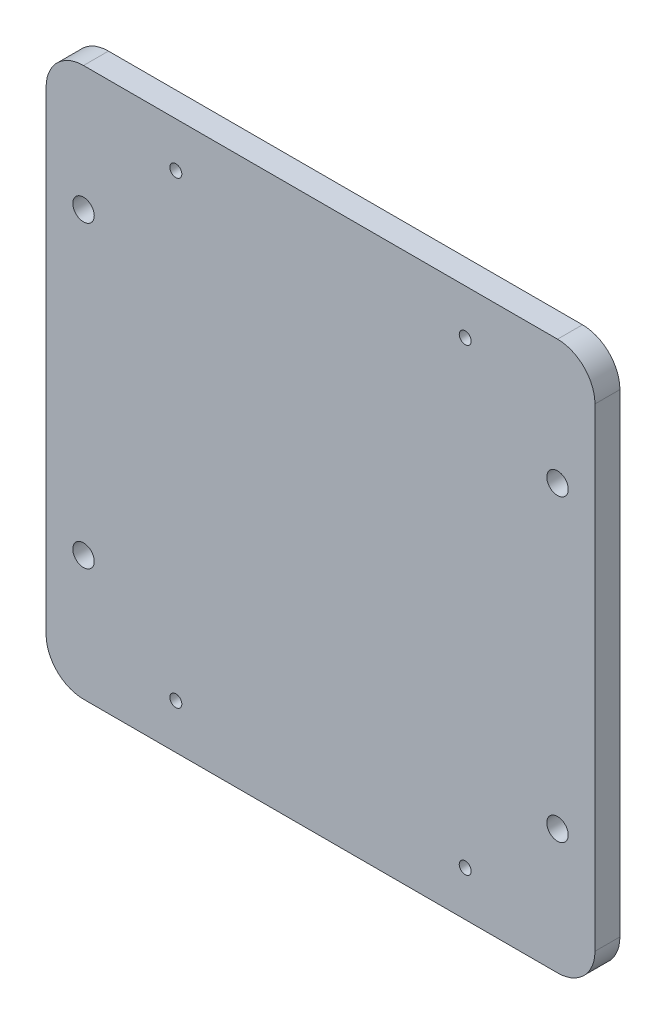
ISO-10303-21;
HEADER;
FILE_DESCRIPTION(('STEP AP214'),'2;1');
FILE_NAME('part.step','',(''),(''),'','','');
FILE_SCHEMA(('AUTOMOTIVE_DESIGN { 1 0 10303 214 1 1 1 1 }'));
ENDSEC;
DATA;
#1=APPLICATION_CONTEXT('core data for automotive mechanical design processes');
#2=APPLICATION_PROTOCOL_DEFINITION('international standard','automotive_design',2000,#1);
#3=PRODUCT_CONTEXT('',#1,'mechanical');
#4=PRODUCT('Part','Part','',(#3));
#5=PRODUCT_RELATED_PRODUCT_CATEGORY('part','',(#4));
#6=PRODUCT_DEFINITION_FORMATION('','',#4);
#7=PRODUCT_DEFINITION_CONTEXT('part definition',#1,'design');
#8=PRODUCT_DEFINITION('design','',#6,#7);
#9=PRODUCT_DEFINITION_SHAPE('','',#8);
#10=(LENGTH_UNIT() NAMED_UNIT(*) SI_UNIT(.MILLI.,.METRE.));
#11=(NAMED_UNIT(*) PLANE_ANGLE_UNIT() SI_UNIT($,.RADIAN.));
#12=(NAMED_UNIT(*) SI_UNIT($,.STERADIAN.) SOLID_ANGLE_UNIT());
#13=UNCERTAINTY_MEASURE_WITH_UNIT(LENGTH_MEASURE(1.E-05),#10,'distance_accuracy_value','');
#14=(GEOMETRIC_REPRESENTATION_CONTEXT(3) GLOBAL_UNCERTAINTY_ASSIGNED_CONTEXT((#13)) GLOBAL_UNIT_ASSIGNED_CONTEXT((#10,
#11,#12)) REPRESENTATION_CONTEXT('',''));
#15=CARTESIAN_POINT('',(0.,0.,0.));
#16=DIRECTION('',(0.,0.,1.));
#17=DIRECTION('',(1.,0.,0.));
#18=AXIS2_PLACEMENT_3D('',#15,#16,#17);
#19=CARTESIAN_POINT('',(0.,0.,0.));
#20=DIRECTION('',(0.,0.,-1.));
#21=DIRECTION('',(-1.,0.,0.));
#22=AXIS2_PLACEMENT_3D('',#19,#20,#21);
#23=PLANE('',#22);
#24=CARTESIAN_POINT('',(-102.5,85.,0.));
#25=DIRECTION('',(0.,0.,1.));
#26=DIRECTION('',(1.,0.,0.));
#27=AXIS2_PLACEMENT_3D('',#24,#25,#26);
#28=CIRCLE('',#27,2.15);
#29=CARTESIAN_POINT('',(-100.35,85.,0.));
#30=VERTEX_POINT('',#29);
#31=EDGE_CURVE('E225',#30,#30,#28,.T.);
#32=ORIENTED_EDGE('',*,*,#31,.T.);
#33=EDGE_LOOP('',(#32));
#34=FACE_BOUND('',#33,.T.);
#35=CARTESIAN_POINT('',(-102.5,25.,0.));
#36=DIRECTION('',(0.,0.,1.));
#37=DIRECTION('',(1.,0.,0.));
#38=AXIS2_PLACEMENT_3D('',#35,#36,#37);
#39=CIRCLE('',#38,2.15);
#40=CARTESIAN_POINT('',(-100.35,25.,0.));
#41=VERTEX_POINT('',#40);
#42=EDGE_CURVE('E219',#41,#41,#39,.T.);
#43=ORIENTED_EDGE('',*,*,#42,.T.);
#44=EDGE_LOOP('',(#43));
#45=FACE_BOUND('',#44,.T.);
#46=CARTESIAN_POINT('',(-7.50000000000001,25.,0.));
#47=DIRECTION('',(0.,0.,1.));
#48=DIRECTION('',(1.,0.,0.));
#49=AXIS2_PLACEMENT_3D('',#46,#47,#48);
#50=CIRCLE('',#49,2.15);
#51=CARTESIAN_POINT('',(-5.35000000000001,25.,0.));
#52=VERTEX_POINT('',#51);
#53=EDGE_CURVE('E213',#52,#52,#50,.T.);
#54=ORIENTED_EDGE('',*,*,#53,.T.);
#55=EDGE_LOOP('',(#54));
#56=FACE_BOUND('',#55,.T.);
#57=DIRECTION('',(-1.,0.,0.));
#58=VECTOR('',#57,1.);
#59=CARTESIAN_POINT('',(0.,110.,0.));
#60=LINE('',#59,#58);
#61=CARTESIAN_POINT('',(-7.5,110.,0.));
#62=VERTEX_POINT('',#61);
#63=CARTESIAN_POINT('',(-102.5,110.,0.));
#64=VERTEX_POINT('',#63);
#65=EDGE_CURVE('E122',#62,#64,#60,.T.);
#66=ORIENTED_EDGE('',*,*,#65,.F.);
#67=CARTESIAN_POINT('',(-7.5,102.5,0.));
#68=DIRECTION('',(0.,0.,-1.));
#69=DIRECTION('',(-1.,0.,0.));
#70=AXIS2_PLACEMENT_3D('',#67,#68,#69);
#71=CIRCLE('',#70,7.5);
#72=CARTESIAN_POINT('',(0.,102.5,0.));
#73=VERTEX_POINT('',#72);
#74=EDGE_CURVE('E105',#62,#73,#71,.T.);
#75=ORIENTED_EDGE('',*,*,#74,.T.);
#76=DIRECTION('',(0.,1.,0.));
#77=VECTOR('',#76,1.);
#78=CARTESIAN_POINT('',(0.,0.,0.));
#79=LINE('',#78,#77);
#80=CARTESIAN_POINT('',(0.,7.5,0.));
#81=VERTEX_POINT('',#80);
#82=EDGE_CURVE('E132',#81,#73,#79,.T.);
#83=ORIENTED_EDGE('',*,*,#82,.F.);
#84=CARTESIAN_POINT('',(-7.5,7.5,0.));
#85=DIRECTION('',(0.,0.,-1.));
#86=DIRECTION('',(-1.,0.,0.));
#87=AXIS2_PLACEMENT_3D('',#84,#85,#86);
#88=CIRCLE('',#87,7.5);
#89=CARTESIAN_POINT('',(-7.5,0.,0.));
#90=VERTEX_POINT('',#89);
#91=EDGE_CURVE('E116',#81,#90,#88,.T.);
#92=ORIENTED_EDGE('',*,*,#91,.T.);
#93=DIRECTION('',(1.,0.,0.));
#94=VECTOR('',#93,1.);
#95=CARTESIAN_POINT('',(0.,0.,0.));
#96=LINE('',#95,#94);
#97=CARTESIAN_POINT('',(-102.5,0.,0.));
#98=VERTEX_POINT('',#97);
#99=EDGE_CURVE('E136',#98,#90,#96,.T.);
#100=ORIENTED_EDGE('',*,*,#99,.F.);
#101=CARTESIAN_POINT('',(-102.5,7.5,0.));
#102=DIRECTION('',(0.,0.,-1.));
#103=DIRECTION('',(-1.,0.,0.));
#104=AXIS2_PLACEMENT_3D('',#101,#102,#103);
#105=CIRCLE('',#104,7.5);
#106=CARTESIAN_POINT('',(-110.,7.5,0.));
#107=VERTEX_POINT('',#106);
#108=EDGE_CURVE('E125',#98,#107,#105,.T.);
#109=ORIENTED_EDGE('',*,*,#108,.T.);
#110=DIRECTION('',(0.,-1.,0.));
#111=VECTOR('',#110,1.);
#112=CARTESIAN_POINT('',(-110.,0.,0.));
#113=LINE('',#112,#111);
#114=CARTESIAN_POINT('',(-110.,102.5,0.));
#115=VERTEX_POINT('',#114);
#116=EDGE_CURVE('E131',#115,#107,#113,.T.);
#117=ORIENTED_EDGE('',*,*,#116,.F.);
#118=CARTESIAN_POINT('',(-102.5,102.5,0.));
#119=DIRECTION('',(0.,0.,-1.));
#120=DIRECTION('',(-1.,0.,0.));
#121=AXIS2_PLACEMENT_3D('',#118,#119,#120);
#122=CIRCLE('',#121,7.5);
#123=EDGE_CURVE('E130',#115,#64,#122,.T.);
#124=ORIENTED_EDGE('',*,*,#123,.T.);
#125=EDGE_LOOP('',(#66,#75,#83,#92,#100,#109,#117,#124));
#126=FACE_BOUND('',#125,.T.);
#127=CARTESIAN_POINT('',(-84.,9.,0.));
#128=DIRECTION('',(0.,0.,1.));
#129=DIRECTION('',(1.,0.,0.));
#130=AXIS2_PLACEMENT_3D('',#127,#128,#129);
#131=CIRCLE('',#130,1.19999999999999);
#132=CARTESIAN_POINT('',(-82.8,9.,0.));
#133=VERTEX_POINT('',#132);
#134=EDGE_CURVE('E179',#133,#133,#131,.T.);
#135=ORIENTED_EDGE('',*,*,#134,.T.);
#136=EDGE_LOOP('',(#135));
#137=FACE_BOUND('',#136,.T.);
#138=CARTESIAN_POINT('',(-26.,8.99999999999999,0.));
#139=DIRECTION('',(0.,0.,1.));
#140=DIRECTION('',(1.,0.,0.));
#141=AXIS2_PLACEMENT_3D('',#138,#139,#140);
#142=CIRCLE('',#141,1.2);
#143=CARTESIAN_POINT('',(-24.8,8.99999999999999,0.));
#144=VERTEX_POINT('',#143);
#145=EDGE_CURVE('E189',#144,#144,#142,.T.);
#146=ORIENTED_EDGE('',*,*,#145,.T.);
#147=EDGE_LOOP('',(#146));
#148=FACE_BOUND('',#147,.T.);
#149=CARTESIAN_POINT('',(-26.,101.,0.));
#150=DIRECTION('',(0.,0.,1.));
#151=DIRECTION('',(1.,0.,0.));
#152=AXIS2_PLACEMENT_3D('',#149,#150,#151);
#153=CIRCLE('',#152,1.2);
#154=CARTESIAN_POINT('',(-24.8,101.,0.));
#155=VERTEX_POINT('',#154);
#156=EDGE_CURVE('E195',#155,#155,#153,.T.);
#157=ORIENTED_EDGE('',*,*,#156,.T.);
#158=EDGE_LOOP('',(#157));
#159=FACE_BOUND('',#158,.T.);
#160=CARTESIAN_POINT('',(-84.,101.,0.));
#161=DIRECTION('',(0.,0.,1.));
#162=DIRECTION('',(1.,0.,0.));
#163=AXIS2_PLACEMENT_3D('',#160,#161,#162);
#164=CIRCLE('',#163,1.19999999999999);
#165=CARTESIAN_POINT('',(-82.8,101.,0.));
#166=VERTEX_POINT('',#165);
#167=EDGE_CURVE('E201',#166,#166,#164,.T.);
#168=ORIENTED_EDGE('',*,*,#167,.T.);
#169=EDGE_LOOP('',(#168));
#170=FACE_BOUND('',#169,.T.);
#171=CARTESIAN_POINT('',(-7.50000000000003,85.,0.));
#172=DIRECTION('',(0.,0.,1.));
#173=DIRECTION('',(1.,0.,0.));
#174=AXIS2_PLACEMENT_3D('',#171,#172,#173);
#175=CIRCLE('',#174,2.15);
#176=CARTESIAN_POINT('',(-5.35000000000004,85.,0.));
#177=VERTEX_POINT('',#176);
#178=EDGE_CURVE('E207',#177,#177,#175,.T.);
#179=ORIENTED_EDGE('',*,*,#178,.T.);
#180=EDGE_LOOP('',(#179));
#181=FACE_BOUND('',#180,.T.);
#182=ADVANCED_FACE('F39',(#34,#45,#56,#126,#137,#148,#159,#170,#181),#23,.T.);
#183=CARTESIAN_POINT('',(0.,0.,5.));
#184=DIRECTION('',(0.,1.,0.));
#185=DIRECTION('',(0.,0.,1.));
#186=AXIS2_PLACEMENT_3D('',#183,#184,#185);
#187=PLANE('',#186);
#188=ORIENTED_EDGE('',*,*,#99,.T.);
#189=DIRECTION('',(0.,0.,-1.));
#190=VECTOR('',#189,1.);
#191=CARTESIAN_POINT('',(-7.5,0.,5.));
#192=LINE('',#191,#190);
#193=CARTESIAN_POINT('',(-7.5,0.,5.));
#194=VERTEX_POINT('',#193);
#195=EDGE_CURVE('E158',#90,#194,#192,.F.);
#196=ORIENTED_EDGE('',*,*,#195,.T.);
#197=DIRECTION('',(1.,0.,0.));
#198=VECTOR('',#197,1.);
#199=CARTESIAN_POINT('',(0.,0.,5.));
#200=LINE('',#199,#198);
#201=CARTESIAN_POINT('',(-102.5,0.,5.));
#202=VERTEX_POINT('',#201);
#203=EDGE_CURVE('E134',#202,#194,#200,.T.);
#204=ORIENTED_EDGE('',*,*,#203,.F.);
#205=DIRECTION('',(0.,0.,-1.));
#206=VECTOR('',#205,1.);
#207=CARTESIAN_POINT('',(-102.5,0.,5.));
#208=LINE('',#207,#206);
#209=EDGE_CURVE('E155',#202,#98,#208,.T.);
#210=ORIENTED_EDGE('',*,*,#209,.T.);
#211=EDGE_LOOP('',(#188,#196,#204,#210));
#212=FACE_BOUND('',#211,.T.);
#213=ADVANCED_FACE('F164',(#212),#187,.F.);
#214=CARTESIAN_POINT('',(0.,0.,5.));
#215=DIRECTION('',(-1.,0.,0.));
#216=DIRECTION('',(0.,0.,1.));
#217=AXIS2_PLACEMENT_3D('',#214,#215,#216);
#218=PLANE('',#217);
#219=ORIENTED_EDGE('',*,*,#82,.T.);
#220=DIRECTION('',(0.,0.,-1.));
#221=VECTOR('',#220,1.);
#222=CARTESIAN_POINT('',(0.,102.5,5.));
#223=LINE('',#222,#221);
#224=CARTESIAN_POINT('',(0.,102.5,5.));
#225=VERTEX_POINT('',#224);
#226=EDGE_CURVE('E110',#73,#225,#223,.F.);
#227=ORIENTED_EDGE('',*,*,#226,.T.);
#228=DIRECTION('',(0.,1.,0.));
#229=VECTOR('',#228,1.);
#230=CARTESIAN_POINT('',(0.,0.,5.));
#231=LINE('',#230,#229);
#232=CARTESIAN_POINT('',(0.,7.5,5.));
#233=VERTEX_POINT('',#232);
#234=EDGE_CURVE('E173',#233,#225,#231,.T.);
#235=ORIENTED_EDGE('',*,*,#234,.F.);
#236=DIRECTION('',(0.,0.,-1.));
#237=VECTOR('',#236,1.);
#238=CARTESIAN_POINT('',(0.,7.5,5.));
#239=LINE('',#238,#237);
#240=EDGE_CURVE('E115',#233,#81,#239,.T.);
#241=ORIENTED_EDGE('',*,*,#240,.T.);
#242=EDGE_LOOP('',(#219,#227,#235,#241));
#243=FACE_BOUND('',#242,.T.);
#244=ADVANCED_FACE('F178',(#243),#218,.F.);
#245=CARTESIAN_POINT('',(0.,110.,5.));
#246=DIRECTION('',(0.,-1.,0.));
#247=DIRECTION('',(0.,0.,-1.));
#248=AXIS2_PLACEMENT_3D('',#245,#246,#247);
#249=PLANE('',#248);
#250=DIRECTION('',(-1.,0.,0.));
#251=VECTOR('',#250,1.);
#252=CARTESIAN_POINT('',(0.,110.,5.));
#253=LINE('',#252,#251);
#254=CARTESIAN_POINT('',(-7.5,110.,5.));
#255=VERTEX_POINT('',#254);
#256=CARTESIAN_POINT('',(-102.5,110.,5.));
#257=VERTEX_POINT('',#256);
#258=EDGE_CURVE('E124',#255,#257,#253,.T.);
#259=ORIENTED_EDGE('',*,*,#258,.F.);
#260=DIRECTION('',(0.,0.,-1.));
#261=VECTOR('',#260,1.);
#262=CARTESIAN_POINT('',(-7.5,110.,5.));
#263=LINE('',#262,#261);
#264=EDGE_CURVE('E109',#255,#62,#263,.T.);
#265=ORIENTED_EDGE('',*,*,#264,.T.);
#266=ORIENTED_EDGE('',*,*,#65,.T.);
#267=DIRECTION('',(0.,0.,-1.));
#268=VECTOR('',#267,1.);
#269=CARTESIAN_POINT('',(-102.5,110.,5.));
#270=LINE('',#269,#268);
#271=EDGE_CURVE('E126',#64,#257,#270,.F.);
#272=ORIENTED_EDGE('',*,*,#271,.T.);
#273=EDGE_LOOP('',(#259,#265,#266,#272));
#274=FACE_BOUND('',#273,.T.);
#275=ADVANCED_FACE('F121',(#274),#249,.F.);
#276=CARTESIAN_POINT('',(-110.,0.,5.));
#277=DIRECTION('',(1.,0.,0.));
#278=DIRECTION('',(0.,0.,-1.));
#279=AXIS2_PLACEMENT_3D('',#276,#277,#278);
#280=PLANE('',#279);
#281=DIRECTION('',(0.,-1.,0.));
#282=VECTOR('',#281,1.);
#283=CARTESIAN_POINT('',(-110.,0.,5.));
#284=LINE('',#283,#282);
#285=CARTESIAN_POINT('',(-110.,102.5,5.));
#286=VERTEX_POINT('',#285);
#287=CARTESIAN_POINT('',(-110.,7.5,5.));
#288=VERTEX_POINT('',#287);
#289=EDGE_CURVE('E140',#286,#288,#284,.T.);
#290=ORIENTED_EDGE('',*,*,#289,.F.);
#291=DIRECTION('',(0.,0.,-1.));
#292=VECTOR('',#291,1.);
#293=CARTESIAN_POINT('',(-110.,102.5,5.));
#294=LINE('',#293,#292);
#295=EDGE_CURVE('E11',#286,#115,#294,.T.);
#296=ORIENTED_EDGE('',*,*,#295,.T.);
#297=ORIENTED_EDGE('',*,*,#116,.T.);
#298=DIRECTION('',(0.,0.,-1.));
#299=VECTOR('',#298,1.);
#300=CARTESIAN_POINT('',(-110.,7.5,5.));
#301=LINE('',#300,#299);
#302=EDGE_CURVE('E47',#107,#288,#301,.F.);
#303=ORIENTED_EDGE('',*,*,#302,.T.);
#304=EDGE_LOOP('',(#290,#296,#297,#303));
#305=FACE_BOUND('',#304,.T.);
#306=ADVANCED_FACE('F237',(#305),#280,.F.);
#307=CARTESIAN_POINT('',(0.,0.,5.));
#308=DIRECTION('',(0.,0.,-1.));
#309=DIRECTION('',(-1.,0.,0.));
#310=AXIS2_PLACEMENT_3D('',#307,#308,#309);
#311=PLANE('',#310);
#312=CARTESIAN_POINT('',(-102.5,85.,5.));
#313=DIRECTION('',(0.,0.,1.));
#314=DIRECTION('',(1.,0.,0.));
#315=AXIS2_PLACEMENT_3D('',#312,#313,#314);
#316=CIRCLE('',#315,2.15);
#317=CARTESIAN_POINT('',(-100.35,85.,5.));
#318=VERTEX_POINT('',#317);
#319=EDGE_CURVE('E228',#318,#318,#316,.T.);
#320=ORIENTED_EDGE('',*,*,#319,.F.);
#321=EDGE_LOOP('',(#320));
#322=FACE_BOUND('',#321,.T.);
#323=CARTESIAN_POINT('',(-102.5,25.,5.));
#324=DIRECTION('',(0.,0.,1.));
#325=DIRECTION('',(1.,0.,0.));
#326=AXIS2_PLACEMENT_3D('',#323,#324,#325);
#327=CIRCLE('',#326,2.15);
#328=CARTESIAN_POINT('',(-100.35,25.,5.));
#329=VERTEX_POINT('',#328);
#330=EDGE_CURVE('E222',#329,#329,#327,.T.);
#331=ORIENTED_EDGE('',*,*,#330,.F.);
#332=EDGE_LOOP('',(#331));
#333=FACE_BOUND('',#332,.T.);
#334=CARTESIAN_POINT('',(-7.50000000000001,25.,5.));
#335=DIRECTION('',(0.,0.,1.));
#336=DIRECTION('',(1.,0.,0.));
#337=AXIS2_PLACEMENT_3D('',#334,#335,#336);
#338=CIRCLE('',#337,2.15);
#339=CARTESIAN_POINT('',(-5.35000000000001,25.,5.));
#340=VERTEX_POINT('',#339);
#341=EDGE_CURVE('E216',#340,#340,#338,.T.);
#342=ORIENTED_EDGE('',*,*,#341,.F.);
#343=EDGE_LOOP('',(#342));
#344=FACE_BOUND('',#343,.T.);
#345=CARTESIAN_POINT('',(-7.50000000000003,85.,5.));
#346=DIRECTION('',(0.,0.,1.));
#347=DIRECTION('',(1.,0.,0.));
#348=AXIS2_PLACEMENT_3D('',#345,#346,#347);
#349=CIRCLE('',#348,2.15);
#350=CARTESIAN_POINT('',(-5.35000000000004,85.,5.));
#351=VERTEX_POINT('',#350);
#352=EDGE_CURVE('E210',#351,#351,#349,.T.);
#353=ORIENTED_EDGE('',*,*,#352,.F.);
#354=EDGE_LOOP('',(#353));
#355=FACE_BOUND('',#354,.T.);
#356=CARTESIAN_POINT('',(-84.,101.,5.));
#357=DIRECTION('',(0.,0.,1.));
#358=DIRECTION('',(1.,0.,0.));
#359=AXIS2_PLACEMENT_3D('',#356,#357,#358);
#360=CIRCLE('',#359,1.19999999999999);
#361=CARTESIAN_POINT('',(-82.8,101.,5.));
#362=VERTEX_POINT('',#361);
#363=EDGE_CURVE('E204',#362,#362,#360,.T.);
#364=ORIENTED_EDGE('',*,*,#363,.F.);
#365=EDGE_LOOP('',(#364));
#366=FACE_BOUND('',#365,.T.);
#367=CARTESIAN_POINT('',(-26.,101.,5.));
#368=DIRECTION('',(0.,0.,1.));
#369=DIRECTION('',(1.,0.,0.));
#370=AXIS2_PLACEMENT_3D('',#367,#368,#369);
#371=CIRCLE('',#370,1.2);
#372=CARTESIAN_POINT('',(-24.8,101.,5.));
#373=VERTEX_POINT('',#372);
#374=EDGE_CURVE('E198',#373,#373,#371,.T.);
#375=ORIENTED_EDGE('',*,*,#374,.F.);
#376=EDGE_LOOP('',(#375));
#377=FACE_BOUND('',#376,.T.);
#378=CARTESIAN_POINT('',(-26.,8.99999999999999,5.));
#379=DIRECTION('',(0.,0.,1.));
#380=DIRECTION('',(1.,0.,0.));
#381=AXIS2_PLACEMENT_3D('',#378,#379,#380);
#382=CIRCLE('',#381,1.2);
#383=CARTESIAN_POINT('',(-24.8,8.99999999999999,5.));
#384=VERTEX_POINT('',#383);
#385=EDGE_CURVE('E192',#384,#384,#382,.T.);
#386=ORIENTED_EDGE('',*,*,#385,.F.);
#387=EDGE_LOOP('',(#386));
#388=FACE_BOUND('',#387,.T.);
#389=CARTESIAN_POINT('',(-84.,9.,5.));
#390=DIRECTION('',(0.,0.,1.));
#391=DIRECTION('',(1.,0.,0.));
#392=AXIS2_PLACEMENT_3D('',#389,#390,#391);
#393=CIRCLE('',#392,1.19999999999999);
#394=CARTESIAN_POINT('',(-82.8,9.,5.));
#395=VERTEX_POINT('',#394);
#396=EDGE_CURVE('E181',#395,#395,#393,.T.);
#397=ORIENTED_EDGE('',*,*,#396,.F.);
#398=EDGE_LOOP('',(#397));
#399=FACE_BOUND('',#398,.T.);
#400=ORIENTED_EDGE('',*,*,#234,.T.);
#401=CARTESIAN_POINT('',(-7.5,102.5,5.));
#402=DIRECTION('',(0.,0.,-1.));
#403=DIRECTION('',(-1.,0.,0.));
#404=AXIS2_PLACEMENT_3D('',#401,#402,#403);
#405=CIRCLE('',#404,7.5);
#406=EDGE_CURVE('E153',#225,#255,#405,.F.);
#407=ORIENTED_EDGE('',*,*,#406,.T.);
#408=ORIENTED_EDGE('',*,*,#258,.T.);
#409=CARTESIAN_POINT('',(-102.5,102.5,5.));
#410=DIRECTION('',(0.,0.,-1.));
#411=DIRECTION('',(-1.,0.,0.));
#412=AXIS2_PLACEMENT_3D('',#409,#410,#411);
#413=CIRCLE('',#412,7.5);
#414=EDGE_CURVE('E60',#257,#286,#413,.F.);
#415=ORIENTED_EDGE('',*,*,#414,.T.);
#416=ORIENTED_EDGE('',*,*,#289,.T.);
#417=CARTESIAN_POINT('',(-102.5,7.5,5.));
#418=DIRECTION('',(0.,0.,-1.));
#419=DIRECTION('',(-1.,0.,0.));
#420=AXIS2_PLACEMENT_3D('',#417,#418,#419);
#421=CIRCLE('',#420,7.5);
#422=EDGE_CURVE('E148',#288,#202,#421,.F.);
#423=ORIENTED_EDGE('',*,*,#422,.T.);
#424=ORIENTED_EDGE('',*,*,#203,.T.);
#425=CARTESIAN_POINT('',(-7.5,7.5,5.));
#426=DIRECTION('',(0.,0.,-1.));
#427=DIRECTION('',(-1.,0.,0.));
#428=AXIS2_PLACEMENT_3D('',#425,#426,#427);
#429=CIRCLE('',#428,7.5);
#430=EDGE_CURVE('E151',#194,#233,#429,.F.);
#431=ORIENTED_EDGE('',*,*,#430,.T.);
#432=EDGE_LOOP('',(#400,#407,#408,#415,#416,#423,#424,#431));
#433=FACE_BOUND('',#432,.T.);
#434=ADVANCED_FACE('F170',(#322,#333,#344,#355,#366,#377,#388,#399,#433),#311,.F.);
#435=CARTESIAN_POINT('',(-84.,9.,5.));
#436=DIRECTION('',(0.,0.,1.));
#437=DIRECTION('',(1.,0.,0.));
#438=AXIS2_PLACEMENT_3D('',#435,#436,#437);
#439=CYLINDRICAL_SURFACE('',#438,1.19999999999999);
#440=ORIENTED_EDGE('',*,*,#134,.F.);
#441=EDGE_LOOP('',(#440));
#442=FACE_BOUND('',#441,.T.);
#443=ORIENTED_EDGE('',*,*,#396,.T.);
#444=EDGE_LOOP('',(#443));
#445=FACE_BOUND('',#444,.T.);
#446=ADVANCED_FACE('F236',(#442,#445),#439,.F.);
#447=CARTESIAN_POINT('',(-26.,8.99999999999999,5.));
#448=DIRECTION('',(0.,0.,1.));
#449=DIRECTION('',(1.,0.,0.));
#450=AXIS2_PLACEMENT_3D('',#447,#448,#449);
#451=CYLINDRICAL_SURFACE('',#450,1.2);
#452=ORIENTED_EDGE('',*,*,#145,.F.);
#453=EDGE_LOOP('',(#452));
#454=FACE_BOUND('',#453,.T.);
#455=ORIENTED_EDGE('',*,*,#385,.T.);
#456=EDGE_LOOP('',(#455));
#457=FACE_BOUND('',#456,.T.);
#458=ADVANCED_FACE('F254',(#454,#457),#451,.F.);
#459=CARTESIAN_POINT('',(-26.,101.,5.));
#460=DIRECTION('',(0.,0.,1.));
#461=DIRECTION('',(1.,0.,0.));
#462=AXIS2_PLACEMENT_3D('',#459,#460,#461);
#463=CYLINDRICAL_SURFACE('',#462,1.2);
#464=ORIENTED_EDGE('',*,*,#156,.F.);
#465=EDGE_LOOP('',(#464));
#466=FACE_BOUND('',#465,.T.);
#467=ORIENTED_EDGE('',*,*,#374,.T.);
#468=EDGE_LOOP('',(#467));
#469=FACE_BOUND('',#468,.T.);
#470=ADVANCED_FACE('F260',(#466,#469),#463,.F.);
#471=CARTESIAN_POINT('',(-84.,101.,5.));
#472=DIRECTION('',(0.,0.,1.));
#473=DIRECTION('',(1.,0.,0.));
#474=AXIS2_PLACEMENT_3D('',#471,#472,#473);
#475=CYLINDRICAL_SURFACE('',#474,1.19999999999999);
#476=ORIENTED_EDGE('',*,*,#167,.F.);
#477=EDGE_LOOP('',(#476));
#478=FACE_BOUND('',#477,.T.);
#479=ORIENTED_EDGE('',*,*,#363,.T.);
#480=EDGE_LOOP('',(#479));
#481=FACE_BOUND('',#480,.T.);
#482=ADVANCED_FACE('F348',(#478,#481),#475,.F.);
#483=CARTESIAN_POINT('',(-7.50000000000003,85.,5.));
#484=DIRECTION('',(0.,0.,1.));
#485=DIRECTION('',(1.,0.,0.));
#486=AXIS2_PLACEMENT_3D('',#483,#484,#485);
#487=CYLINDRICAL_SURFACE('',#486,2.15);
#488=ORIENTED_EDGE('',*,*,#178,.F.);
#489=EDGE_LOOP('',(#488));
#490=FACE_BOUND('',#489,.T.);
#491=ORIENTED_EDGE('',*,*,#352,.T.);
#492=EDGE_LOOP('',(#491));
#493=FACE_BOUND('',#492,.T.);
#494=ADVANCED_FACE('F338',(#490,#493),#487,.F.);
#495=CARTESIAN_POINT('',(-7.50000000000001,25.,5.));
#496=DIRECTION('',(0.,0.,1.));
#497=DIRECTION('',(1.,0.,0.));
#498=AXIS2_PLACEMENT_3D('',#495,#496,#497);
#499=CYLINDRICAL_SURFACE('',#498,2.15);
#500=ORIENTED_EDGE('',*,*,#53,.F.);
#501=EDGE_LOOP('',(#500));
#502=FACE_BOUND('',#501,.T.);
#503=ORIENTED_EDGE('',*,*,#341,.T.);
#504=EDGE_LOOP('',(#503));
#505=FACE_BOUND('',#504,.T.);
#506=ADVANCED_FACE('F328',(#502,#505),#499,.F.);
#507=CARTESIAN_POINT('',(-102.5,25.,5.));
#508=DIRECTION('',(0.,0.,1.));
#509=DIRECTION('',(1.,0.,0.));
#510=AXIS2_PLACEMENT_3D('',#507,#508,#509);
#511=CYLINDRICAL_SURFACE('',#510,2.15);
#512=ORIENTED_EDGE('',*,*,#42,.F.);
#513=EDGE_LOOP('',(#512));
#514=FACE_BOUND('',#513,.T.);
#515=ORIENTED_EDGE('',*,*,#330,.T.);
#516=EDGE_LOOP('',(#515));
#517=FACE_BOUND('',#516,.T.);
#518=ADVANCED_FACE('F318',(#514,#517),#511,.F.);
#519=CARTESIAN_POINT('',(-102.5,85.,5.));
#520=DIRECTION('',(0.,0.,1.));
#521=DIRECTION('',(1.,0.,0.));
#522=AXIS2_PLACEMENT_3D('',#519,#520,#521);
#523=CYLINDRICAL_SURFACE('',#522,2.15);
#524=ORIENTED_EDGE('',*,*,#31,.F.);
#525=EDGE_LOOP('',(#524));
#526=FACE_BOUND('',#525,.T.);
#527=ORIENTED_EDGE('',*,*,#319,.T.);
#528=EDGE_LOOP('',(#527));
#529=FACE_BOUND('',#528,.T.);
#530=ADVANCED_FACE('F232',(#526,#529),#523,.F.);
#531=CARTESIAN_POINT('',(-7.5,102.5,5.));
#532=DIRECTION('',(0.,0.,-1.));
#533=DIRECTION('',(-1.,0.,0.));
#534=AXIS2_PLACEMENT_3D('',#531,#532,#533);
#535=CYLINDRICAL_SURFACE('',#534,7.5);
#536=ORIENTED_EDGE('',*,*,#406,.F.);
#537=ORIENTED_EDGE('',*,*,#226,.F.);
#538=ORIENTED_EDGE('',*,*,#74,.F.);
#539=ORIENTED_EDGE('',*,*,#264,.F.);
#540=EDGE_LOOP('',(#536,#537,#538,#539));
#541=FACE_BOUND('',#540,.T.);
#542=ADVANCED_FACE('F108',(#541),#535,.T.);
#543=CARTESIAN_POINT('',(-7.5,7.5,5.));
#544=DIRECTION('',(0.,0.,-1.));
#545=DIRECTION('',(-1.,0.,0.));
#546=AXIS2_PLACEMENT_3D('',#543,#544,#545);
#547=CYLINDRICAL_SURFACE('',#546,7.5);
#548=ORIENTED_EDGE('',*,*,#430,.F.);
#549=ORIENTED_EDGE('',*,*,#195,.F.);
#550=ORIENTED_EDGE('',*,*,#91,.F.);
#551=ORIENTED_EDGE('',*,*,#240,.F.);
#552=EDGE_LOOP('',(#548,#549,#550,#551));
#553=FACE_BOUND('',#552,.T.);
#554=ADVANCED_FACE('F176',(#553),#547,.T.);
#555=CARTESIAN_POINT('',(-102.5,102.5,5.));
#556=DIRECTION('',(0.,0.,-1.));
#557=DIRECTION('',(-1.,0.,0.));
#558=AXIS2_PLACEMENT_3D('',#555,#556,#557);
#559=CYLINDRICAL_SURFACE('',#558,7.5);
#560=ORIENTED_EDGE('',*,*,#414,.F.);
#561=ORIENTED_EDGE('',*,*,#271,.F.);
#562=ORIENTED_EDGE('',*,*,#123,.F.);
#563=ORIENTED_EDGE('',*,*,#295,.F.);
#564=EDGE_LOOP('',(#560,#561,#562,#563));
#565=FACE_BOUND('',#564,.T.);
#566=ADVANCED_FACE('F283',(#565),#559,.T.);
#567=CARTESIAN_POINT('',(-102.5,7.5,5.));
#568=DIRECTION('',(0.,0.,-1.));
#569=DIRECTION('',(-1.,0.,0.));
#570=AXIS2_PLACEMENT_3D('',#567,#568,#569);
#571=CYLINDRICAL_SURFACE('',#570,7.5);
#572=ORIENTED_EDGE('',*,*,#422,.F.);
#573=ORIENTED_EDGE('',*,*,#302,.F.);
#574=ORIENTED_EDGE('',*,*,#108,.F.);
#575=ORIENTED_EDGE('',*,*,#209,.F.);
#576=EDGE_LOOP('',(#572,#573,#574,#575));
#577=FACE_BOUND('',#576,.T.);
#578=ADVANCED_FACE('F41',(#577),#571,.T.);
#579=CLOSED_SHELL('',(#182,#213,#244,#275,#306,#434,#446,#458,#470,#482,#494,#506,#518,#530,
#542,#554,#566,#578));
#580=MANIFOLD_SOLID_BREP('B2',#579);
#581=ADVANCED_BREP_SHAPE_REPRESENTATION('',(#18,#580),#14);
#582=SHAPE_DEFINITION_REPRESENTATION(#9,#581);
ENDSEC;
END-ISO-10303-21;
